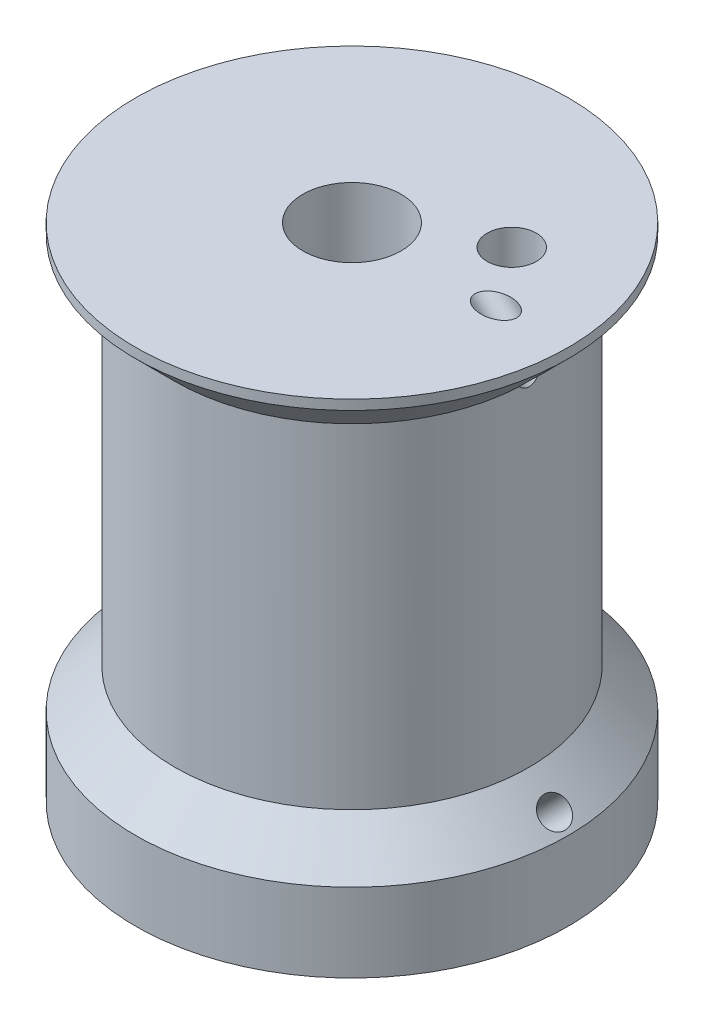
ISO-10303-21;
HEADER;
FILE_DESCRIPTION(('STEP AP214'),'2;1');
FILE_NAME('part.step','',(''),(''),'','','');
FILE_SCHEMA(('AUTOMOTIVE_DESIGN { 1 0 10303 214 1 1 1 1 }'));
ENDSEC;
DATA;
#1=APPLICATION_CONTEXT('core data for automotive mechanical design processes');
#2=APPLICATION_PROTOCOL_DEFINITION('international standard','automotive_design',2000,#1);
#3=PRODUCT_CONTEXT('',#1,'mechanical');
#4=PRODUCT('Part','Part','',(#3));
#5=PRODUCT_RELATED_PRODUCT_CATEGORY('part','',(#4));
#6=PRODUCT_DEFINITION_FORMATION('','',#4);
#7=PRODUCT_DEFINITION_CONTEXT('part definition',#1,'design');
#8=PRODUCT_DEFINITION('design','',#6,#7);
#9=PRODUCT_DEFINITION_SHAPE('','',#8);
#10=(LENGTH_UNIT() NAMED_UNIT(*) SI_UNIT(.MILLI.,.METRE.));
#11=(NAMED_UNIT(*) PLANE_ANGLE_UNIT() SI_UNIT($,.RADIAN.));
#12=(NAMED_UNIT(*) SI_UNIT($,.STERADIAN.) SOLID_ANGLE_UNIT());
#13=UNCERTAINTY_MEASURE_WITH_UNIT(LENGTH_MEASURE(1.E-05),#10,'distance_accuracy_value','');
#14=(GEOMETRIC_REPRESENTATION_CONTEXT(3) GLOBAL_UNCERTAINTY_ASSIGNED_CONTEXT((#13)) GLOBAL_UNIT_ASSIGNED_CONTEXT((#10,
#11,#12)) REPRESENTATION_CONTEXT('',''));
#15=CARTESIAN_POINT('',(0.,0.,0.));
#16=DIRECTION('',(0.,0.,1.));
#17=DIRECTION('',(1.,0.,0.));
#18=AXIS2_PLACEMENT_3D('',#15,#16,#17);
#19=CARTESIAN_POINT('',(0.,0.,0.));
#20=DIRECTION('',(0.,-1.,0.));
#21=DIRECTION('',(0.,0.,-1.));
#22=AXIS2_PLACEMENT_3D('',#19,#20,#21);
#23=CYLINDRICAL_SURFACE('',#22,2.5);
#24=CARTESIAN_POINT('',(-2.1650635094611,2.,-1.25));
#25=CARTESIAN_POINT('',(-2.16506918410574,2.06513476024406,-1.24999545384316));
#26=CARTESIAN_POINT('',(-2.16804751484696,2.13035176440631,-1.24487496341652));
#27=CARTESIAN_POINT('',(-2.17952958065066,2.25878408084644,-1.22465401237256));
#28=CARTESIAN_POINT('',(-2.18804492569449,2.32199489380426,-1.20953258069272));
#29=CARTESIAN_POINT('',(-2.20936683256748,2.44431458042993,-1.17012493587476));
#30=CARTESIAN_POINT('',(-2.22215054341565,2.50344331559198,-1.14588744061716));
#31=CARTESIAN_POINT('',(-2.25053331021072,2.6167802524959,-1.08908440672046));
#32=CARTESIAN_POINT('',(-2.26613251845081,2.67098818782807,-1.05651841754472));
#33=CARTESIAN_POINT('',(-2.29996086321802,2.77788216069688,-0.980833175663597));
#34=CARTESIAN_POINT('',(-2.31830079547442,2.83007391959193,-0.937065045179712));
#35=CARTESIAN_POINT('',(-2.35464978482132,2.92676048550839,-0.841567259518084));
#36=CARTESIAN_POINT('',(-2.37265867289062,2.9712514532294,-0.789833657227865));
#37=CARTESIAN_POINT('',(-2.40776846191186,3.05420893893458,-0.675611954268181));
#38=CARTESIAN_POINT('',(-2.42472633022716,3.09206720982441,-0.612633986265717));
#39=CARTESIAN_POINT('',(-2.45438445124411,3.1564260665572,-0.480196283249379));
#40=CARTESIAN_POINT('',(-2.46708738979677,3.18293382017146,-0.410740672672693));
#41=CARTESIAN_POINT('',(-2.48600576555297,3.22188082662637,-0.272556179907471));
#42=CARTESIAN_POINT('',(-2.49261850276115,3.23518690794442,-0.204127238111021));
#43=CARTESIAN_POINT('',(-2.50009479807584,3.2502076483438,-0.0657132858723097));
#44=CARTESIAN_POINT('',(-2.50096183480737,3.25192932099464,0.00427075730467342));
#45=CARTESIAN_POINT('',(-2.49703727395563,3.24406665753706,0.137290655529688));
#46=CARTESIAN_POINT('',(-2.492731198652,3.23545248059847,0.200401498970989));
#47=CARTESIAN_POINT('',(-2.47967806574684,3.20889894511918,0.324142214897902));
#48=CARTESIAN_POINT('',(-2.47093067582992,3.19095888877972,0.384771901367407));
#49=CARTESIAN_POINT('',(-2.44964479109568,3.14614679238773,0.502886739461942));
#50=CARTESIAN_POINT('',(-2.43705551911499,3.11915460853491,0.560316779393972));
#51=CARTESIAN_POINT('',(-2.40922057483359,3.05717072974813,0.66997100189166));
#52=CARTESIAN_POINT('',(-2.39397395196855,3.02217617087206,0.722193311048306));
#53=CARTESIAN_POINT('',(-2.36055492999036,2.94138081058373,0.825217076122743));
#54=CARTESIAN_POINT('',(-2.34224219997719,2.89487121459249,0.8754175937867));
#55=CARTESIAN_POINT('',(-2.30567925733515,2.79426284383728,0.967630462872224));
#56=CARTESIAN_POINT('',(-2.28742910332036,2.74015828465742,1.00963651446779));
#57=CARTESIAN_POINT('',(-2.25180195115606,2.62168975946989,1.08688166830276));
#58=CARTESIAN_POINT('',(-2.23455399988384,2.55689247118223,1.12152164372256));
#59=CARTESIAN_POINT('',(-2.2046931284822,2.42132791080125,1.17914889125154));
#60=CARTESIAN_POINT('',(-2.19207537557584,2.35056695872805,1.20214832276361));
#61=CARTESIAN_POINT('',(-2.17430794771293,2.21098186089651,1.2339752637813));
#62=CARTESIAN_POINT('',(-2.16864569810621,2.14244860119556,1.24378140264997));
#63=CARTESIAN_POINT('',(-2.16397399202012,2.00449832310432,1.25189618326428));
#64=CARTESIAN_POINT('',(-2.1649598361164,1.93508196360027,1.25021294664378));
#65=CARTESIAN_POINT('',(-2.17292920675731,1.80543260177659,1.23629505417996));
#66=CARTESIAN_POINT('',(-2.17924484383318,1.74502568611509,1.22523477089058));
#67=CARTESIAN_POINT('',(-2.19617526939176,1.6270402671613,1.19462035579055));
#68=CARTESIAN_POINT('',(-2.20679145006292,1.56946268656674,1.17506347327952));
#69=CARTESIAN_POINT('',(-2.23170277599571,1.45573583637163,1.12705948575611));
#70=CARTESIAN_POINT('',(-2.24614554053829,1.39977622893306,1.0982425796159));
#71=CARTESIAN_POINT('',(-2.27695149371562,1.29316341057626,1.03285883001975));
#72=CARTESIAN_POINT('',(-2.29331566693935,1.2425129456084,0.996288005415268));
#73=CARTESIAN_POINT('',(-2.3285999807042,1.14127654059557,0.911046458998565));
#74=CARTESIAN_POINT('',(-2.34758228942861,1.09150356160293,0.861431590393706));
#75=CARTESIAN_POINT('',(-2.38417793722366,1.00073470250801,0.754255619247859));
#76=CARTESIAN_POINT('',(-2.40179081259637,0.959741787211827,0.696691843319182));
#77=CARTESIAN_POINT('',(-2.43426702113696,0.886782842562374,0.573169203198445));
#78=CARTESIAN_POINT('',(-2.44904552090037,0.855083602236364,0.50702887196764));
#79=CARTESIAN_POINT('',(-2.47354193699126,0.803577620178261,0.369402955801351));
#80=CARTESIAN_POINT('',(-2.48326429595466,0.783760435792121,0.297922126740219));
#81=CARTESIAN_POINT('',(-2.49584385227353,0.758289294781675,0.15872460291302));
#82=CARTESIAN_POINT('',(-2.49924909885239,0.75150265515486,0.0912643048130703));
#83=CARTESIAN_POINT('',(-2.50052662968914,0.748945918182,-0.0439074824390054));
#84=CARTESIAN_POINT('',(-2.49840085083612,0.753171964345547,-0.111618875368859));
#85=CARTESIAN_POINT('',(-2.48917461047403,0.771770508494532,-0.240672490396434));
#86=CARTESIAN_POINT('',(-2.48241118334987,0.785456061572091,-0.30214039726408));
#87=CARTESIAN_POINT('',(-2.46490117079279,0.821658749128716,-0.421807440229522));
#88=CARTESIAN_POINT('',(-2.45415401415995,0.844177150116818,-0.480006106194386));
#89=CARTESIAN_POINT('',(-2.4290741343515,0.898408815207469,-0.594279257806106));
#90=CARTESIAN_POINT('',(-2.41460771498499,0.930474154009801,-0.650156428375057));
#91=CARTESIAN_POINT('',(-2.38360166427283,1.00244741357382,-0.75596830226753));
#92=CARTESIAN_POINT('',(-2.36706108197951,1.04235893639459,-0.805900259268633));
#93=CARTESIAN_POINT('',(-2.33160762783285,1.13349642377838,-0.903642505196113));
#94=CARTESIAN_POINT('',(-2.31262248764622,1.18545310934649,-0.950747105674088));
#95=CARTESIAN_POINT('',(-2.27578845203565,1.29681340141221,-1.03582910924334));
#96=CARTESIAN_POINT('',(-2.25794057202332,1.35622352608461,-1.07379843751257));
#97=CARTESIAN_POINT('',(-2.22499506631145,1.4832958082262,-1.14053884973207));
#98=CARTESIAN_POINT('',(-2.21000217820338,1.55115941391092,-1.16898133245117));
#99=CARTESIAN_POINT('',(-2.1858269541044,1.69166550542472,-1.21359838688301));
#100=CARTESIAN_POINT('',(-2.17662520184628,1.76429111114086,-1.22981398896918));
#101=CARTESIAN_POINT('',(-2.16911590752238,1.864756694565,-1.24295875983052));
#102=CARTESIAN_POINT('',(-2.1676016125644,1.89170986799736,-1.24559513120481));
#103=CARTESIAN_POINT('',(-2.16557419859688,1.94577060085281,-1.24911675636245));
#104=CARTESIAN_POINT('',(-2.16506114656387,1.97287817048234,-1.25000189299984));
#105=CARTESIAN_POINT('',(-2.1650635094611,2.,-1.25));
#106=B_SPLINE_CURVE_WITH_KNOTS('',3,(#24,#25,#26,#27,#28,#29,#30,#31,#32,#33,#34,#35,#36,#37,
#38,#39,#40,#41,#42,#43,#44,#45,#46,#47,#48,#49,#50,#51,#52,#53,#54,#55,#56,#57,#58,#59,#60,#61,
#62,#63,#64,#65,#66,#67,#68,#69,#70,#71,#72,#73,#74,#75,#76,#77,#78,#79,#80,#81,#82,#83,#84,#85,
#86,#87,#88,#89,#90,#91,#92,#93,#94,#95,#96,#97,#98,#99,#100,#101,#102,#103,#104,#105),
.UNSPECIFIED.,.T.,.F.,(4,2,2,2,2,2,2,2,2,2,2,2,2,2,2,2,2,2,2,2,2,2,2,2,2,2,2,2,2,2,2,2,2,2,2,2,
2,2,2,2,4),(0.,0.195290153243394,0.390991116031005,0.585660744898606,0.780340906806436,
0.991077890622791,1.20191963855464,1.42697365298454,1.65188533704864,1.86079356209919,
2.0695752960755,2.26020121855673,2.45084140646819,2.64411918413933,2.83746624187839,
3.04908989321113,3.26087560307398,3.4861105216181,3.71110967764631,3.91827863567764,
4.12530116485466,4.30967729280031,4.49411315545078,4.68709120507609,4.88016857775058,
5.09758429475766,5.31507331222752,5.53830226766206,5.76133474760964,5.96390337986858,
6.16640108492464,6.35555531089365,6.54473666890015,6.74200938399339,6.93937287625898,
7.15637802312583,7.37357428556442,7.59763436298255,7.82093916253449,7.90225168981635,
7.98356965618174),.UNSPECIFIED.);
#107=CARTESIAN_POINT('',(-2.1650635094611,2.,-1.25));
#108=VERTEX_POINT('',#107);
#109=EDGE_CURVE('E80',#108,#108,#106,.T.);
#110=ORIENTED_EDGE('',*,*,#109,.F.);
#111=EDGE_LOOP('',(#110));
#112=FACE_BOUND('',#111,.T.);
#113=CARTESIAN_POINT('',(0.,0.,0.));
#114=DIRECTION('',(0.,-1.,0.));
#115=DIRECTION('',(0.,0.,-1.));
#116=AXIS2_PLACEMENT_3D('',#113,#114,#115);
#117=CIRCLE('',#116,2.5);
#118=CARTESIAN_POINT('',(0.,0.,-2.5));
#119=VERTEX_POINT('',#118);
#120=EDGE_CURVE('E165',#119,#119,#117,.T.);
#121=ORIENTED_EDGE('',*,*,#120,.T.);
#122=EDGE_LOOP('',(#121));
#123=FACE_BOUND('',#122,.T.);
#124=CARTESIAN_POINT('',(0.,25.5,0.));
#125=DIRECTION('',(0.,-1.,0.));
#126=DIRECTION('',(0.,0.,-1.));
#127=AXIS2_PLACEMENT_3D('',#124,#125,#126);
#128=CIRCLE('',#127,2.5);
#129=CARTESIAN_POINT('',(0.,25.5,-2.5));
#130=VERTEX_POINT('',#129);
#131=EDGE_CURVE('E73',#130,#130,#128,.T.);
#132=ORIENTED_EDGE('',*,*,#131,.F.);
#133=EDGE_LOOP('',(#132));
#134=FACE_BOUND('',#133,.T.);
#135=ADVANCED_FACE('F44',(#112,#123,#134),#23,.F.);
#136=CARTESIAN_POINT('',(2.5,25.5,0.));
#137=DIRECTION('',(0.,1.,0.));
#138=DIRECTION('',(0.,0.,1.));
#139=AXIS2_PLACEMENT_3D('',#136,#137,#138);
#140=PLANE('',#139);
#141=CARTESIAN_POINT('',(7.32304473782996,25.5,0.));
#142=DIRECTION('',(0.,1.,0.));
#143=DIRECTION('',(1.,0.,0.));
#144=AXIS2_PLACEMENT_3D('',#141,#142,#143);
#145=ELLIPSE('',#144,1.06066017177983,0.750000000000008);
#146=CARTESIAN_POINT('',(8.38370490960979,25.5,0.));
#147=VERTEX_POINT('',#146);
#148=EDGE_CURVE('E79',#147,#147,#145,.T.);
#149=ORIENTED_EDGE('',*,*,#148,.F.);
#150=EDGE_LOOP('',(#149));
#151=FACE_BOUND('',#150,.T.);
#152=CARTESIAN_POINT('',(5.15285115251741,25.5,-2.97500000000001));
#153=DIRECTION('',(0.,-1.,0.));
#154=DIRECTION('',(0.,0.,-1.));
#155=AXIS2_PLACEMENT_3D('',#152,#153,#154);
#156=CIRCLE('',#155,1.25);
#157=CARTESIAN_POINT('',(5.15285115251741,25.5,-4.225));
#158=VERTEX_POINT('',#157);
#159=EDGE_CURVE('E156',#158,#158,#156,.T.);
#160=ORIENTED_EDGE('',*,*,#159,.T.);
#161=EDGE_LOOP('',(#160));
#162=FACE_BOUND('',#161,.T.);
#163=ORIENTED_EDGE('',*,*,#131,.T.);
#164=EDGE_LOOP('',(#163));
#165=FACE_BOUND('',#164,.T.);
#166=CARTESIAN_POINT('',(0.,25.5,0.));
#167=DIRECTION('',(0.,-1.,0.));
#168=DIRECTION('',(0.,0.,-1.));
#169=AXIS2_PLACEMENT_3D('',#166,#167,#168);
#170=CIRCLE('',#169,11.);
#171=CARTESIAN_POINT('',(0.,25.5,-11.));
#172=VERTEX_POINT('',#171);
#173=EDGE_CURVE('E90',#172,#172,#170,.T.);
#174=ORIENTED_EDGE('',*,*,#173,.F.);
#175=EDGE_LOOP('',(#174));
#176=FACE_BOUND('',#175,.T.);
#177=ADVANCED_FACE('F142',(#151,#162,#165,#176),#140,.T.);
#178=CARTESIAN_POINT('',(0.,0.,0.));
#179=DIRECTION('',(0.,-1.,0.));
#180=DIRECTION('',(0.,0.,-1.));
#181=AXIS2_PLACEMENT_3D('',#178,#179,#180);
#182=CYLINDRICAL_SURFACE('',#181,11.);
#183=ORIENTED_EDGE('',*,*,#173,.T.);
#184=EDGE_LOOP('',(#183));
#185=FACE_BOUND('',#184,.T.);
#186=CARTESIAN_POINT('',(0.,25.,0.));
#187=DIRECTION('',(0.,-1.,0.));
#188=DIRECTION('',(0.,0.,-1.));
#189=AXIS2_PLACEMENT_3D('',#186,#187,#188);
#190=CIRCLE('',#189,11.);
#191=CARTESIAN_POINT('',(0.,25.,-11.));
#192=VERTEX_POINT('',#191);
#193=EDGE_CURVE('E85',#192,#192,#190,.T.);
#194=ORIENTED_EDGE('',*,*,#193,.F.);
#195=EDGE_LOOP('',(#194));
#196=FACE_BOUND('',#195,.T.);
#197=ADVANCED_FACE('F140',(#185,#196),#182,.T.);
#198=CARTESIAN_POINT('',(0.,23.,0.));
#199=DIRECTION('',(0.,1.,0.));
#200=DIRECTION('',(0.,0.,1.));
#201=AXIS2_PLACEMENT_3D('',#198,#199,#200);
#202=CONICAL_SURFACE('',#201,9.,0.785398163397446);
#203=CARTESIAN_POINT('',(8.88161431999982,22.8816678967813,-0.030849627066394));
#204=CARTESIAN_POINT('',(8.88274582869261,22.8829334226516,-0.0729732285452958));
#205=CARTESIAN_POINT('',(8.8862803370737,22.8869253125928,-0.11494516954378));
#206=CARTESIAN_POINT('',(8.89797107778,22.9000673054394,-0.197317977882754));
#207=CARTESIAN_POINT('',(8.90611722039618,22.9092061472003,-0.237722069963994));
#208=CARTESIAN_POINT('',(8.92530067419323,22.9306220818726,-0.310032418678407));
#209=CARTESIAN_POINT('',(8.93572230089305,22.9422242228074,-0.34230512522119));
#210=CARTESIAN_POINT('',(8.9596006444316,22.9686666571026,-0.404306417190066));
#211=CARTESIAN_POINT('',(8.97305787615031,22.983507499777,-0.434034569843808));
#212=CARTESIAN_POINT('',(9.00545280097263,23.0190103289053,-0.495388150055858));
#213=CARTESIAN_POINT('',(9.02494037323841,23.0402388304158,-0.526399880168298));
#214=CARTESIAN_POINT('',(9.06736053994946,23.0860536704431,-0.583161969563023));
#215=CARTESIAN_POINT('',(9.09029493706475,23.1106417653934,-0.608909558998339));
#216=CARTESIAN_POINT('',(9.13902386013079,23.1623986028429,-0.654395823276607));
#217=CARTESIAN_POINT('',(9.16481794618277,23.1895669483367,-0.674135420569048));
#218=CARTESIAN_POINT('',(9.21859157332957,23.2456548307265,-0.707043960466121));
#219=CARTESIAN_POINT('',(9.24657081461639,23.2745741272663,-0.720213802630004));
#220=CARTESIAN_POINT('',(9.3039345582121,23.3332820176307,-0.739601501095803));
#221=CARTESIAN_POINT('',(9.33331779387443,23.3630698187958,-0.745825504717208));
#222=CARTESIAN_POINT('',(9.392690786181,23.4226794300728,-0.751163975654432));
#223=CARTESIAN_POINT('',(9.42268055581832,23.4525012409004,-0.750278290506272));
#224=CARTESIAN_POINT('',(9.48236980997519,23.5113094453906,-0.741427583423478));
#225=CARTESIAN_POINT('',(9.51206956872455,23.540296691851,-0.733470073581445));
#226=CARTESIAN_POINT('',(9.57033639836122,23.596680207193,-0.710713898155468));
#227=CARTESIAN_POINT('',(9.59890346914631,23.624076475931,-0.695915231954133));
#228=CARTESIAN_POINT('',(9.65406701187643,23.6765729080305,-0.659885010395318));
#229=CARTESIAN_POINT('',(9.68066205213758,23.7016714062652,-0.638648837264752));
#230=CARTESIAN_POINT('',(9.73104614189844,23.7489031848808,-0.59034950160208));
#231=CARTESIAN_POINT('',(9.75483516642883,23.7710364388756,-0.563286287224118));
#232=CARTESIAN_POINT('',(9.7988982348556,23.8118059298411,-0.504058692704155));
#233=CARTESIAN_POINT('',(9.81916763257134,23.8304375470095,-0.47188767544934));
#234=CARTESIAN_POINT('',(9.85551427275934,23.8637037719416,-0.403380406728823));
#235=CARTESIAN_POINT('',(9.87159151480563,23.8783383792992,-0.36704415483987));
#236=CARTESIAN_POINT('',(9.89904034437634,23.9032494709511,-0.291236762362103));
#237=CARTESIAN_POINT('',(9.91041207326956,23.9135260861739,-0.2517657159951));
#238=CARTESIAN_POINT('',(9.92808367640848,23.9294697255588,-0.17080874449825));
#239=CARTESIAN_POINT('',(9.93438359309978,23.9351367882979,-0.129322836233704));
#240=CARTESIAN_POINT('',(9.94170249492394,23.9417187283792,-0.0455687183761259));
#241=CARTESIAN_POINT('',(9.94272800172335,23.9426394744181,-0.0033015397676239));
#242=CARTESIAN_POINT('',(9.93948236525668,23.9397221793188,0.0808634707939466));
#243=CARTESIAN_POINT('',(9.93521124288315,23.9358841569517,0.12276130420324));
#244=CARTESIAN_POINT('',(9.92151519939422,23.9235467154391,0.204972690916994));
#245=CARTESIAN_POINT('',(9.91209335999349,23.9150500835675,0.245287176107481));
#246=CARTESIAN_POINT('',(9.88840172288213,23.8936046553429,0.323217035604245));
#247=CARTESIAN_POINT('',(9.8741318989955,23.880655834951,0.360832395335652));
#248=CARTESIAN_POINT('',(9.8411849692463,23.850609511234,0.432334012359926));
#249=CARTESIAN_POINT('',(9.82250386433773,23.833508243108,0.466216844815542));
#250=CARTESIAN_POINT('',(9.78133192964549,23.7955861358268,0.529257062809947));
#251=CARTESIAN_POINT('',(9.75884106769669,23.7747652652675,0.558414408448193));
#252=CARTESIAN_POINT('',(9.71072507811604,23.7299014451254,0.611208429231745));
#253=CARTESIAN_POINT('',(9.68509655706882,23.7058550043144,0.634839045349554));
#254=CARTESIAN_POINT('',(9.6315149388439,23.6551736684123,0.675867475541703));
#255=CARTESIAN_POINT('',(9.60356184234548,23.6285387740777,0.693265291437363));
#256=CARTESIAN_POINT('',(9.54619021898808,23.5733901478848,0.721326632907051));
#257=CARTESIAN_POINT('',(9.516772232887,23.5448771080996,0.731992623913005));
#258=CARTESIAN_POINT('',(9.45733883499075,23.4867340417291,0.746294271594801));
#259=CARTESIAN_POINT('',(9.42732344407161,23.4571040541428,0.749930173499623));
#260=CARTESIAN_POINT('',(9.36761247220403,23.3975932338718,0.750067734622433));
#261=CARTESIAN_POINT('',(9.33791649329497,23.3677128233757,0.746579649666177));
#262=CARTESIAN_POINT('',(9.27963539760036,23.308506665282,0.732587676749721));
#263=CARTESIAN_POINT('',(9.25105044326983,23.279180999119,0.722082766836492));
#264=CARTESIAN_POINT('',(9.1957819296247,23.2219523776551,0.694360536498083));
#265=CARTESIAN_POINT('',(9.16909831761696,23.1940493829327,0.677143402178818));
#266=CARTESIAN_POINT('',(9.11834487413941,23.14051375168,0.636487769439473));
#267=CARTESIAN_POINT('',(9.09427327425245,23.1148795812766,0.613053517709259));
#268=CARTESIAN_POINT('',(9.05614895793403,23.0739641475048,0.568583342789967));
#269=CARTESIAN_POINT('',(9.04126642131312,23.0578947630582,0.548961608468778));
#270=CARTESIAN_POINT('',(9.01324929874434,23.0274926891902,0.507306072353426));
#271=CARTESIAN_POINT('',(9.00011276126508,23.013158062434,0.485275014588835));
#272=CARTESIAN_POINT('',(8.97991223712239,22.9910193979255,0.447015889580604));
#273=CARTESIAN_POINT('',(8.97230990920025,22.9826607473243,0.431386295454281));
#274=CARTESIAN_POINT('',(8.95795797338659,22.9668395487621,0.399308918148919));
#275=CARTESIAN_POINT('',(8.95120836377152,22.9593769989899,0.382861136623731));
#276=CARTESIAN_POINT('',(8.93112895469329,22.9371259545831,0.329321680222511));
#277=CARTESIAN_POINT('',(8.91945562798399,22.9241089385642,0.290816714827937));
#278=CARTESIAN_POINT('',(8.9053141648647,22.9082935473374,0.231233426377925));
#279=CARTESIAN_POINT('',(8.90115453430154,22.9036319056499,0.211005731978682));
#280=CARTESIAN_POINT('',(8.89399509612589,22.8955982473684,0.170102743907071));
#281=CARTESIAN_POINT('',(8.8909948249382,22.8922257153238,0.149427632635781));
#282=CARTESIAN_POINT('',(8.88857964345208,22.8895096691334,0.12858491212465));
#283=B_SPLINE_CURVE_WITH_KNOTS('',3,(#203,#204,#205,#206,#207,#208,#209,#210,#211,#212,#213,
#214,#215,#216,#217,#218,#219,#220,#221,#222,#223,#224,#225,#226,#227,#228,#229,#230,#231,#232,
#233,#234,#235,#236,#237,#238,#239,#240,#241,#242,#243,#244,#245,#246,#247,#248,#249,#250,#251,
#252,#253,#254,#255,#256,#257,#258,#259,#260,#261,#262,#263,#264,#265,#266,#267,#268,#269,#270,
#271,#272,#273,#274,#275,#276,#277,#278,#279,#280,#281,#282),.UNSPECIFIED.,.F.,.F.,(4,2,2,2,2,2,
2,2,2,2,2,2,2,2,2,2,2,2,2,2,2,2,2,2,2,2,2,2,2,2,2,2,2,2,2,2,2,2,2,4),(0.,0.126323120079672,
0.252370922406531,0.359541784081294,0.466730837080839,0.59311640927633,0.719568311925693,
0.846000789715478,0.97241595106931,1.09871914146294,1.22502504037715,1.35119693017318,
1.47736883135581,1.60363145360113,1.72989519930927,1.85632437634916,1.98275356623613,
2.10917895750652,2.23560329072183,2.36187126599043,2.48813874319675,2.61433075612492,
2.74052345041959,2.86683098686996,2.99313958976636,3.11958602408659,3.24603242145719,
3.37243248278037,3.49882813483975,3.62504195359989,3.75127415855715,3.8775028637969,
4.00364556774543,4.09168044539758,4.17961608238923,4.23741846506333,4.29522073090279,
4.42137125551434,4.48482135763164,4.54824606261526),.UNSPECIFIED.);
#284=CARTESIAN_POINT('',(8.98810663157903,23.,-0.462535597943624));
#285=VERTEX_POINT('',#284);
#286=CARTESIAN_POINT('',(8.98810663157903,23.,0.462535597943621));
#287=VERTEX_POINT('',#286);
#288=EDGE_CURVE('E66',#285,#287,#283,.T.);
#289=ORIENTED_EDGE('',*,*,#288,.F.);
#290=CARTESIAN_POINT('',(0.,23.,0.));
#291=DIRECTION('',(0.,-1.,0.));
#292=DIRECTION('',(0.,0.,-1.));
#293=AXIS2_PLACEMENT_3D('',#290,#291,#292);
#294=CIRCLE('',#293,9.);
#295=EDGE_CURVE('E77',#287,#285,#294,.T.);
#296=ORIENTED_EDGE('',*,*,#295,.F.);
#297=EDGE_LOOP('',(#289,#296));
#298=FACE_BOUND('',#297,.T.);
#299=ORIENTED_EDGE('',*,*,#193,.T.);
#300=EDGE_LOOP('',(#299));
#301=FACE_BOUND('',#300,.T.);
#302=ADVANCED_FACE('F75',(#298,#301),#202,.T.);
#303=CARTESIAN_POINT('',(0.,0.,0.));
#304=DIRECTION('',(0.,-1.,0.));
#305=DIRECTION('',(0.,0.,-1.));
#306=AXIS2_PLACEMENT_3D('',#303,#304,#305);
#307=CYLINDRICAL_SURFACE('',#306,9.);
#308=CARTESIAN_POINT('',(8.98810663157903,23.,0.462535597943624));
#309=CARTESIAN_POINT('',(8.98938034335362,22.9712603139431,0.437751411739013));
#310=CARTESIAN_POINT('',(8.99065375420055,22.9439667611519,0.411040257737929));
#311=CARTESIAN_POINT('',(8.9930966306683,22.893391359135,0.353631129830954));
#312=CARTESIAN_POINT('',(8.99426500603353,22.8701496546463,0.322898022253863));
#313=CARTESIAN_POINT('',(8.99618582641261,22.8328878352046,0.26337140129142));
#314=CARTESIAN_POINT('',(8.99697524109227,22.8179696292036,0.235150415214562));
#315=CARTESIAN_POINT('',(8.99831250364838,22.7930374967018,0.176697864955878));
#316=CARTESIAN_POINT('',(8.99886119861095,22.7830063587408,0.146473789039552));
#317=CARTESIAN_POINT('',(8.99965773861761,22.7685279439411,0.0844289748867665));
#318=CARTESIAN_POINT('',(8.99990313158228,22.7641261685428,0.0525973611904858));
#319=CARTESIAN_POINT('',(9.00004958344311,22.7614928519145,-0.0113389508008687));
#320=CARTESIAN_POINT('',(8.99995054371652,22.7632630779378,-0.0434437246855372));
#321=CARTESIAN_POINT('',(8.99945275363935,22.7722530702756,-0.10316028673399));
#322=CARTESIAN_POINT('',(8.99908893583646,22.7788380557168,-0.130871534681401));
#323=CARTESIAN_POINT('',(8.99814075702215,22.7962441993527,-0.184918559769681));
#324=CARTESIAN_POINT('',(8.99755628723906,22.8070674469213,-0.211253651225462));
#325=CARTESIAN_POINT('',(8.99598775236296,22.8366797209498,-0.270876683578972));
#326=CARTESIAN_POINT('',(8.99493539124961,22.8569283753646,-0.303436117591944));
#327=CARTESIAN_POINT('',(8.99265560419564,22.9023966975402,-0.364822959583717));
#328=CARTESIAN_POINT('',(8.99142800847248,22.9276211954902,-0.393646695807122));
#329=CARTESIAN_POINT('',(8.98948717739386,22.9692903660139,-0.435117905442909));
#330=CARTESIAN_POINT('',(8.98879750916101,22.9844265534231,-0.449100398248913));
#331=CARTESIAN_POINT('',(8.98810663157903,23.,-0.462535597943638));
#332=B_SPLINE_CURVE_WITH_KNOTS('',3,(#308,#309,#310,#311,#312,#313,#314,#315,#316,#317,#318,
#319,#320,#321,#322,#323,#324,#325,#326,#327,#328,#329,#330,#331),.UNSPECIFIED.,.F.,.F.,(4,2,2,
2,2,2,2,2,2,2,2,4),(0.,0.114098687434545,0.229270484127822,0.324673752160922,0.419738551837097,
0.515566990235433,0.611422869819685,0.696506385610814,0.78163189869223,0.896070279386068,
1.01062030016049,1.0724003739315),.UNSPECIFIED.);
#333=EDGE_CURVE('E58',#287,#285,#332,.T.);
#334=ORIENTED_EDGE('',*,*,#333,.F.);
#335=ORIENTED_EDGE('',*,*,#295,.T.);
#336=EDGE_LOOP('',(#334,#335));
#337=FACE_BOUND('',#336,.T.);
#338=CARTESIAN_POINT('',(0.,5.99999999999999,0.));
#339=DIRECTION('',(0.,-1.,0.));
#340=DIRECTION('',(0.,0.,-1.));
#341=AXIS2_PLACEMENT_3D('',#338,#339,#340);
#342=CIRCLE('',#341,9.);
#343=CARTESIAN_POINT('',(0.,5.99999999999999,-9.));
#344=VERTEX_POINT('',#343);
#345=EDGE_CURVE('E86',#344,#344,#342,.T.);
#346=ORIENTED_EDGE('',*,*,#345,.F.);
#347=EDGE_LOOP('',(#346));
#348=FACE_BOUND('',#347,.T.);
#349=ADVANCED_FACE('F82',(#337,#348),#307,.T.);
#350=CARTESIAN_POINT('',(0.,4.,0.));
#351=DIRECTION('',(0.,-1.,0.));
#352=DIRECTION('',(0.,0.,-1.));
#353=AXIS2_PLACEMENT_3D('',#350,#351,#352);
#354=CONICAL_SURFACE('',#353,11.,0.78539816339745);
#355=CARTESIAN_POINT('',(9.9631797927056,5.02031448599402,-0.573734587316648));
#356=CARTESIAN_POINT('',(9.94115291455935,5.04386493421888,-0.546598623625871));
#357=CARTESIAN_POINT('',(9.92076097358022,5.06584062633196,-0.516722279117505));
#358=CARTESIAN_POINT('',(9.88377466275405,5.10592926216682,-0.452337877536927));
#359=CARTESIAN_POINT('',(9.86718480594557,5.12403761367275,-0.417824392479662));
#360=CARTESIAN_POINT('',(9.83823055839378,5.15578077407838,-0.345175044796419));
#361=CARTESIAN_POINT('',(9.82586435061316,5.16941750659238,-0.307040748909909));
#362=CARTESIAN_POINT('',(9.80564720051552,5.19177494534494,-0.228231264908273));
#363=CARTESIAN_POINT('',(9.79779512414358,5.20049688628267,-0.187556717812581));
#364=CARTESIAN_POINT('',(9.78678885788826,5.21273648909006,-0.104842086405908));
#365=CARTESIAN_POINT('',(9.78363139369152,5.21625777820503,-0.0628029747575339));
#366=CARTESIAN_POINT('',(9.78207775596649,5.21798942136423,0.0214735839295831));
#367=CARTESIAN_POINT('',(9.78368173740344,5.21619960255398,0.0637110373788593));
#368=CARTESIAN_POINT('',(9.79160983951947,5.20737329838287,0.14713877526187));
#369=CARTESIAN_POINT('',(9.79792916998201,5.20034213759003,0.188330078574184));
#370=CARTESIAN_POINT('',(9.81513487568354,5.18127327101196,0.268542679287046));
#371=CARTESIAN_POINT('',(9.82602126476407,5.16923555005316,0.307563970110451));
#372=CARTESIAN_POINT('',(9.85211330440535,5.14053911936981,0.382358815494115));
#373=CARTESIAN_POINT('',(9.86732187686605,5.12387728381189,0.418130151344092));
#374=CARTESIAN_POINT('',(9.90169029647595,5.08647435900022,0.485385090628383));
#375=CARTESIAN_POINT('',(9.92085016864672,5.06573324391451,0.516868666908395));
#376=CARTESIAN_POINT('',(9.96267617681338,5.02080071104094,0.574694434059573));
#377=CARTESIAN_POINT('',(9.98534658127262,4.99660509575026,0.60103027640819));
#378=CARTESIAN_POINT('',(10.0336015335835,4.94553426284994,0.647765097723217));
#379=CARTESIAN_POINT('',(10.0591860791319,4.91865904735816,0.668164081381902));
#380=CARTESIAN_POINT('',(10.1125932896623,4.86305120377964,0.702440699388722));
#381=CARTESIAN_POINT('',(10.1404154928487,4.83431895917562,0.71631967527665));
#382=CARTESIAN_POINT('',(10.1975487297479,4.7758451401449,0.737165563644688));
#383=CARTESIAN_POINT('',(10.2268597508585,4.74610357426238,0.744132534621736));
#384=CARTESIAN_POINT('',(10.2861153774062,4.68650906473225,0.750950822635799));
#385=CARTESIAN_POINT('',(10.3160591697763,4.65665630031188,0.750810774831437));
#386=CARTESIAN_POINT('',(10.3757569192181,4.59764436726409,0.743440788109808));
#387=CARTESIAN_POINT('',(10.4055108765487,4.56848519769084,0.736210858861139));
#388=CARTESIAN_POINT('',(10.4639492683511,4.51166765238241,0.714870819563185));
#389=CARTESIAN_POINT('',(10.4926339792588,4.48400888788874,0.700762501274244));
#390=CARTESIAN_POINT('',(10.5480862086227,4.43092217359872,0.666068182896486));
#391=CARTESIAN_POINT('',(10.5748537140905,4.40549423891509,0.645482138928758));
#392=CARTESIAN_POINT('',(10.6256864195977,4.35750683975816,0.598391335743807));
#393=CARTESIAN_POINT('',(10.6497487749806,4.3349503916182,0.571880432022058));
#394=CARTESIAN_POINT('',(10.6943976961991,4.29331407876543,0.513702805662361));
#395=CARTESIAN_POINT('',(10.7149842450292,4.27423423106193,0.482036057800828));
#396=CARTESIAN_POINT('',(10.7520526045689,4.24001933167818,0.414417433626332));
#397=CARTESIAN_POINT('',(10.7685313997897,4.22488717761,0.378462437782754));
#398=CARTESIAN_POINT('',(10.7968433572382,4.19896406378902,0.30330500258384));
#399=CARTESIAN_POINT('',(10.8086765386688,4.18817308609167,0.264102576652802));
#400=CARTESIAN_POINT('',(10.8273136390078,4.17120543328313,0.183588277609497));
#401=CARTESIAN_POINT('',(10.8341206533128,4.16502591814852,0.142277719593181));
#402=CARTESIAN_POINT('',(10.8424986159879,4.15742314427964,0.0586991568197074));
#403=CARTESIAN_POINT('',(10.844069597463,4.15599985547388,0.0164311581177186));
#404=CARTESIAN_POINT('',(10.841926027722,4.15794363772392,-0.067817558419549));
#405=CARTESIAN_POINT('',(10.8382167441945,4.16130593459175,-0.109798520642711));
#406=CARTESIAN_POINT('',(10.8256414109314,4.1727293228843,-0.192324068674023));
#407=CARTESIAN_POINT('',(10.8167753642434,4.18079041153217,-0.232868655331017));
#408=CARTESIAN_POINT('',(10.7941690531923,4.20141319554295,-0.31137602557259));
#409=CARTESIAN_POINT('',(10.7804283331092,4.21397531169578,-0.349338567373252));
#410=CARTESIAN_POINT('',(10.7485086688445,4.24328852878527,-0.421604235459344));
#411=CARTESIAN_POINT('',(10.7303296853371,4.26003966683926,-0.455907329315952));
#412=CARTESIAN_POINT('',(10.6900829183299,4.2973319404294,-0.519918619510079));
#413=CARTESIAN_POINT('',(10.6680110860282,4.31787702295712,-0.549621970832914));
#414=CARTESIAN_POINT('',(10.6206772040672,4.36222488845078,-0.603549914183064));
#415=CARTESIAN_POINT('',(10.5954151376112,4.38602768856875,-0.627774477362516));
#416=CARTESIAN_POINT('',(10.5424627759047,4.43628885109231,-0.670067601429747));
#417=CARTESIAN_POINT('',(10.5147713456593,4.46274845559588,-0.68813326542447));
#418=CARTESIAN_POINT('',(10.4578090216591,4.51761431782162,-0.717577187255727));
#419=CARTESIAN_POINT('',(10.4285381977291,4.5460204895011,-0.72895574046508));
#420=CARTESIAN_POINT('',(10.369315649872,4.60398270793193,-0.744693471104523));
#421=CARTESIAN_POINT('',(10.3393646195252,4.63353760348554,-0.749059499407386));
#422=CARTESIAN_POINT('',(10.2796171764736,4.69301101681191,-0.75066769107941));
#423=CARTESIAN_POINT('',(10.2498208017985,4.72292961848792,-0.747908178383529));
#424=CARTESIAN_POINT('',(10.1912528258573,4.78225308861612,-0.735346627178682));
#425=CARTESIAN_POINT('',(10.1624807466148,4.81165819333383,-0.725547919870115));
#426=CARTESIAN_POINT('',(10.1067605783605,4.86908888620091,-0.699196047682325));
#427=CARTESIAN_POINT('',(10.0798103980325,4.89711604562034,-0.682650785945098));
#428=CARTESIAN_POINT('',(10.0378541717596,4.9410954553659,-0.650516003219222));
#429=CARTESIAN_POINT('',(10.0220865676306,4.95771287172063,-0.63679281272851));
#430=CARTESIAN_POINT('',(9.99172087323401,4.98986868275979,-0.606990623431959));
#431=CARTESIAN_POINT('',(9.97712278338973,5.00540707705363,-0.59091162377335));
#432=CARTESIAN_POINT('',(9.9631797927056,5.02031448599402,-0.573734587316648));
#433=B_SPLINE_CURVE_WITH_KNOTS('',3,(#355,#356,#357,#358,#359,#360,#361,#362,#363,#364,#365,
#366,#367,#368,#369,#370,#371,#372,#373,#374,#375,#376,#377,#378,#379,#380,#381,#382,#383,#384,
#385,#386,#387,#388,#389,#390,#391,#392,#393,#394,#395,#396,#397,#398,#399,#400,#401,#402,#403,
#404,#405,#406,#407,#408,#409,#410,#411,#412,#413,#414,#415,#416,#417,#418,#419,#420,#421,#422,
#423,#424,#425,#426,#427,#428,#429,#430,#431,#432),.UNSPECIFIED.,.T.,.F.,(4,2,2,2,2,2,2,2,2,2,2,
2,2,2,2,2,2,2,2,2,2,2,2,2,2,2,2,2,2,2,2,2,2,2,2,2,2,2,4),(0.,0.12633656965516,0.252822331799376,
0.379253610322497,0.505653112468849,0.631964414349724,0.758279827183331,0.884467093446827,
1.01065474215358,1.13692790050038,1.26320185849556,1.38963057662584,1.51605919483121,
1.64246178800782,1.76886331141845,1.89511125833313,2.02135903308146,2.14757393894264,
2.27378969977854,2.40013696787453,2.52648485410923,2.65292522056987,2.7793650643746,
2.90572697430504,3.03208808530431,3.15832322446521,3.28455828902461,3.41080515806793,
3.53705314577647,3.66343322189354,3.78981396343333,3.91625406752925,4.04268858628665,
4.16899950978667,4.2953401467649,4.42162103415672,4.54775441489012,4.62772530156907,
4.7076962171964),.UNSPECIFIED.);
#434=CARTESIAN_POINT('',(9.9631797927056,5.02031448599402,-0.573734587316648));
#435=VERTEX_POINT('',#434);
#436=EDGE_CURVE('E107',#435,#435,#433,.T.);
#437=ORIENTED_EDGE('',*,*,#436,.F.);
#438=EDGE_LOOP('',(#437));
#439=FACE_BOUND('',#438,.T.);
#440=ORIENTED_EDGE('',*,*,#345,.T.);
#441=EDGE_LOOP('',(#440));
#442=FACE_BOUND('',#441,.T.);
#443=CARTESIAN_POINT('',(0.,4.,0.));
#444=DIRECTION('',(0.,-1.,0.));
#445=DIRECTION('',(0.,0.,-1.));
#446=AXIS2_PLACEMENT_3D('',#443,#444,#445);
#447=CIRCLE('',#446,11.);
#448=CARTESIAN_POINT('',(0.,4.,-11.));
#449=VERTEX_POINT('',#448);
#450=EDGE_CURVE('E94',#449,#449,#447,.T.);
#451=ORIENTED_EDGE('',*,*,#450,.F.);
#452=EDGE_LOOP('',(#451));
#453=FACE_BOUND('',#452,.T.);
#454=ADVANCED_FACE('F189',(#439,#442,#453),#354,.T.);
#455=CARTESIAN_POINT('',(0.,0.,0.));
#456=DIRECTION('',(0.,-1.,0.));
#457=DIRECTION('',(0.,0.,-1.));
#458=AXIS2_PLACEMENT_3D('',#455,#456,#457);
#459=CYLINDRICAL_SURFACE('',#458,11.);
#460=CARTESIAN_POINT('',(-11.,0.750000000000002,0.));
#461=CARTESIAN_POINT('',(-10.999999098796,0.75000300181186,0.0699710602463519));
#462=CARTESIAN_POINT('',(-10.9993252987046,0.755894934903591,0.139987069063113));
#463=CARTESIAN_POINT('',(-10.996702178266,0.7793079628343,0.278074243505269));
#464=CARTESIAN_POINT('',(-10.9947514907003,0.796841523154798,0.346143242753095));
#465=CARTESIAN_POINT('',(-10.9897945640633,0.843017540858324,0.478317045301571));
#466=CARTESIAN_POINT('',(-10.9867890005829,0.871652889372938,0.542424355017517));
#467=CARTESIAN_POINT('',(-10.9800574647103,0.939204897009987,0.664910051163532));
#468=CARTESIAN_POINT('',(-10.9763316253718,0.978119657742116,0.72328949268251));
#469=CARTESIAN_POINT('',(-10.968557071608,1.06531705174659,0.832943192201769));
#470=CARTESIAN_POINT('',(-10.9645070990459,1.11363734567632,0.884187415913991));
#471=CARTESIAN_POINT('',(-10.9565510031881,1.21819350340992,0.977857611459198));
#472=CARTESIAN_POINT('',(-10.9526448868951,1.27442975190413,1.0202831544839));
#473=CARTESIAN_POINT('',(-10.9454062056308,1.39341348322575,1.09522113283392));
#474=CARTESIAN_POINT('',(-10.9420752550327,1.45617852551518,1.12770585724159));
#475=CARTESIAN_POINT('',(-10.9363802408844,1.58631696754945,1.18166312999782));
#476=CARTESIAN_POINT('',(-10.9340161468672,1.65369022200522,1.20313602534931));
#477=CARTESIAN_POINT('',(-10.9305342775891,1.79082316719185,1.23436981435034));
#478=CARTESIAN_POINT('',(-10.9294111476981,1.86057125567857,1.24418104088519));
#479=CARTESIAN_POINT('',(-10.928521890078,2.00073240783944,1.25196865940665));
#480=CARTESIAN_POINT('',(-10.9287557169125,2.07114544916936,1.24994544765987));
#481=CARTESIAN_POINT('',(-10.9305490559729,2.2102888090358,1.23416301698983));
#482=CARTESIAN_POINT('',(-10.9321023319257,2.27902548124253,1.22045900541516));
#483=CARTESIAN_POINT('',(-10.9363498240334,2.41321702690382,1.18179000539199));
#484=CARTESIAN_POINT('',(-10.9390440596154,2.47867184445713,1.15682482519952));
#485=CARTESIAN_POINT('',(-10.9452770263127,2.60461456038531,1.09628205008229));
#486=CARTESIAN_POINT('',(-10.9488176820281,2.66509071066626,1.0606802226634));
#487=CARTESIAN_POINT('',(-10.9563429994385,2.77923074844801,0.979892129097649));
#488=CARTESIAN_POINT('',(-10.9603276779232,2.83289437818587,0.934705500466705));
#489=CARTESIAN_POINT('',(-10.9683198318057,2.93220668102333,0.835723376133609));
#490=CARTESIAN_POINT('',(-10.9723273076041,2.97780789501232,0.781880249551105));
#491=CARTESIAN_POINT('',(-10.9798921650149,3.05933220127938,0.667278205581041));
#492=CARTESIAN_POINT('',(-10.9834495458722,3.09525527732034,0.606519276591014));
#493=CARTESIAN_POINT('',(-10.9897150774974,3.15640268250194,0.479775541657342));
#494=CARTESIAN_POINT('',(-10.9924230139116,3.181624311744,0.413789421907935));
#495=CARTESIAN_POINT('',(-10.9966825017733,3.22061659603785,0.278481205096859));
#496=CARTESIAN_POINT('',(-10.9982340979176,3.23438769369753,0.209159237088376));
#497=CARTESIAN_POINT('',(-11.0000003081264,3.25002712152088,0.0695577812372834));
#498=CARTESIAN_POINT('',(-11.0002222716223,3.25196088285575,-0.00071428718998362));
#499=CARTESIAN_POINT('',(-10.9993239851522,3.24404302418306,-0.140581487877392));
#500=CARTESIAN_POINT('',(-10.9982037587135,3.23419161075723,-0.210176631981748));
#501=CARTESIAN_POINT('',(-10.994751592849,3.20303737153296,-0.346523396585517));
#502=CARTESIAN_POINT('',(-10.9924229265985,3.18176547385961,-0.413282173840754));
#503=CARTESIAN_POINT('',(-10.9868148348929,3.12840607278895,-0.542284372808936));
#504=CARTESIAN_POINT('',(-10.9835353823457,3.09631826119348,-0.604527665792277));
#505=CARTESIAN_POINT('',(-10.9763735736619,3.02207767403193,-0.723026006046938));
#506=CARTESIAN_POINT('',(-10.9724886880503,2.97988225284938,-0.779254179921578));
#507=CARTESIAN_POINT('',(-10.9645592695384,2.88668494139087,-0.883853426159773));
#508=CARTESIAN_POINT('',(-10.9605147314369,2.83568276402336,-0.932224242281435));
#509=CARTESIAN_POINT('',(-10.9526994422005,2.72603277643457,-1.01996547066726));
#510=CARTESIAN_POINT('',(-10.9489300605485,2.66735031149943,-1.05929271449872));
#511=CARTESIAN_POINT('',(-10.942113624429,2.54417501313466,-1.12753292733449));
#512=CARTESIAN_POINT('',(-10.9390665576492,2.4796822787693,-1.15644607385569));
#513=CARTESIAN_POINT('',(-10.9340487479586,2.34686064941341,-1.20296631338929));
#514=CARTESIAN_POINT('',(-10.9320756279092,2.27854059908403,-1.22059839191764));
#515=CARTESIAN_POINT('',(-10.9294220488897,2.13988581391373,-1.24413675347569));
#516=CARTESIAN_POINT('',(-10.9287415409866,2.06955115543999,-1.25004348037982));
#517=CARTESIAN_POINT('',(-10.9287514804399,1.92929294213423,-1.24995628412517));
#518=CARTESIAN_POINT('',(-10.9294341158956,1.85936933480677,-1.2440301726015));
#519=CARTESIAN_POINT('',(-10.9320766991578,1.72151837858343,-1.22058843708507));
#520=CARTESIAN_POINT('',(-10.9340366477846,1.65359103096959,-1.20307280564944));
#521=CARTESIAN_POINT('',(-10.9390107260672,1.5216657259474,-1.15696926667395));
#522=CARTESIAN_POINT('',(-10.9420246021864,1.4576668278464,-1.12838402190138));
#523=CARTESIAN_POINT('',(-10.9487674156768,1.33536375994651,-1.06095945000961));
#524=CARTESIAN_POINT('',(-10.9524963558113,1.27705961215604,-1.02212008326359));
#525=CARTESIAN_POINT('',(-10.9602747641055,1.16745387099977,-0.935036488100243));
#526=CARTESIAN_POINT('',(-10.96432588332,1.1161925813971,-0.8867416772836));
#527=CARTESIAN_POINT('',(-10.972277338952,1.02247431190935,-0.782221793226735));
#528=CARTESIAN_POINT('',(-10.9761776393339,0.980019425717455,-0.725994839471984));
#529=CARTESIAN_POINT('',(-10.9834013412845,0.905007986270545,-0.60700591544028));
#530=CARTESIAN_POINT('',(-10.9867228740683,0.87248325124877,-0.544223785737748));
#531=CARTESIAN_POINT('',(-10.9923953332668,0.818482935662286,-0.414088724760014));
#532=CARTESIAN_POINT('',(-10.9947473329669,0.796995130554922,-0.346740944451991));
#533=CARTESIAN_POINT('',(-10.9976371163841,0.770926038573902,-0.232523699684408));
#534=CARTESIAN_POINT('',(-10.9985189706332,0.763089781495161,-0.186379504843379));
#535=CARTESIAN_POINT('',(-10.9997007118951,0.752625774103816,-0.0934968952111785));
#536=CARTESIAN_POINT('',(-11.0000006022337,0.749997994025379,-0.0467584838174205));
#537=CARTESIAN_POINT('',(-11.,0.750000000000002,0.));
#538=B_SPLINE_CURVE_WITH_KNOTS('',3,(#460,#461,#462,#463,#464,#465,#466,#467,#468,#469,#470,
#471,#472,#473,#474,#475,#476,#477,#478,#479,#480,#481,#482,#483,#484,#485,#486,#487,#488,#489,
#490,#491,#492,#493,#494,#495,#496,#497,#498,#499,#500,#501,#502,#503,#504,#505,#506,#507,#508,
#509,#510,#511,#512,#513,#514,#515,#516,#517,#518,#519,#520,#521,#522,#523,#524,#525,#526,#527,
#528,#529,#530,#531,#532,#533,#534,#535,#536,#537),.UNSPECIFIED.,.T.,.F.,(4,2,2,2,2,2,2,2,2,2,2,
2,2,2,2,2,2,2,2,2,2,2,2,2,2,2,2,2,2,2,2,2,2,2,2,2,2,2,4),(0.,0.209742411074566,
0.419709770574087,0.629542902006036,0.839337308750921,1.04998970573655,1.26065234329854,
1.47189698188367,1.68313496335364,1.89345787180112,2.10377373779622,2.3131010579944,
2.52243194254448,2.73224341085967,2.94206281537295,3.15307892807648,3.36409539480161,
3.5751650678632,3.78622658187584,3.99612038686367,4.20601051268754,4.41533507552063,
4.6246656035362,4.8348953883765,5.04513202779437,5.25635228791533,5.46756894744209,
5.67831616606273,5.88905540649306,6.09859040856625,6.30812554520446,6.51761030997686,
6.72709588430992,6.93773434219369,7.14842282141903,7.35977947100787,7.57090151365797,
7.71106364850651,7.85122498234264),.UNSPECIFIED.);
#539=CARTESIAN_POINT('',(-11.,0.750000000000002,0.));
#540=VERTEX_POINT('',#539);
#541=EDGE_CURVE('E11',#540,#540,#538,.T.);
#542=ORIENTED_EDGE('',*,*,#541,.F.);
#543=EDGE_LOOP('',(#542));
#544=FACE_BOUND('',#543,.T.);
#545=ORIENTED_EDGE('',*,*,#450,.T.);
#546=EDGE_LOOP('',(#545));
#547=FACE_BOUND('',#546,.T.);
#548=CARTESIAN_POINT('',(0.,0.,0.));
#549=DIRECTION('',(0.,-1.,0.));
#550=DIRECTION('',(0.,0.,-1.));
#551=AXIS2_PLACEMENT_3D('',#548,#549,#550);
#552=CIRCLE('',#551,11.);
#553=CARTESIAN_POINT('',(0.,0.,-11.));
#554=VERTEX_POINT('',#553);
#555=EDGE_CURVE('E171',#554,#554,#552,.T.);
#556=ORIENTED_EDGE('',*,*,#555,.F.);
#557=EDGE_LOOP('',(#556));
#558=FACE_BOUND('',#557,.T.);
#559=ADVANCED_FACE('F186',(#544,#547,#558),#459,.T.);
#560=CARTESIAN_POINT('',(11.,0.,0.));
#561=DIRECTION('',(0.,-1.,0.));
#562=DIRECTION('',(0.,0.,-1.));
#563=AXIS2_PLACEMENT_3D('',#560,#561,#562);
#564=PLANE('',#563);
#565=CARTESIAN_POINT('',(5.62598846298224,0.,0.));
#566=DIRECTION('',(0.,-1.,0.));
#567=DIRECTION('',(1.,0.,0.));
#568=AXIS2_PLACEMENT_3D('',#565,#566,#567);
#569=ELLIPSE('',#568,1.06066017177982,0.75);
#570=CARTESIAN_POINT('',(6.68664863476206,0.,0.));
#571=VERTEX_POINT('',#570);
#572=EDGE_CURVE('E104',#571,#571,#569,.T.);
#573=ORIENTED_EDGE('',*,*,#572,.F.);
#574=EDGE_LOOP('',(#573));
#575=FACE_BOUND('',#574,.T.);
#576=CARTESIAN_POINT('',(5.15285115251741,0.,-2.97500000000001));
#577=DIRECTION('',(0.,-1.,0.));
#578=DIRECTION('',(0.,0.,-1.));
#579=AXIS2_PLACEMENT_3D('',#576,#577,#578);
#580=CIRCLE('',#579,1.25);
#581=CARTESIAN_POINT('',(5.15285115251741,0.,-4.225));
#582=VERTEX_POINT('',#581);
#583=EDGE_CURVE('E166',#582,#582,#580,.T.);
#584=ORIENTED_EDGE('',*,*,#583,.F.);
#585=EDGE_LOOP('',(#584));
#586=FACE_BOUND('',#585,.T.);
#587=ORIENTED_EDGE('',*,*,#555,.T.);
#588=EDGE_LOOP('',(#587));
#589=FACE_BOUND('',#588,.T.);
#590=ORIENTED_EDGE('',*,*,#120,.F.);
#591=EDGE_LOOP('',(#590));
#592=FACE_BOUND('',#591,.T.);
#593=ADVANCED_FACE('F196',(#575,#586,#589,#592),#564,.T.);
#594=CARTESIAN_POINT('',(5.15285115251741,25.5,-2.97500000000001));
#595=DIRECTION('',(0.,-1.,0.));
#596=DIRECTION('',(0.,0.,-1.));
#597=AXIS2_PLACEMENT_3D('',#594,#595,#596);
#598=CYLINDRICAL_SURFACE('',#597,1.25);
#599=ORIENTED_EDGE('',*,*,#159,.F.);
#600=EDGE_LOOP('',(#599));
#601=FACE_BOUND('',#600,.T.);
#602=ORIENTED_EDGE('',*,*,#583,.T.);
#603=EDGE_LOOP('',(#602));
#604=FACE_BOUND('',#603,.T.);
#605=ADVANCED_FACE('F204',(#601,#604),#598,.F.);
#606=CARTESIAN_POINT('',(10.3129942314911,4.68700576850888,0.));
#607=DIRECTION('',(0.707106781186547,0.707106781186548,0.));
#608=DIRECTION('',(-0.707106781186548,0.707106781186547,0.));
#609=AXIS2_PLACEMENT_3D('',#606,#607,#608);
#610=CYLINDRICAL_SURFACE('',#609,0.75);
#611=ORIENTED_EDGE('',*,*,#436,.T.);
#612=EDGE_LOOP('',(#611));
#613=FACE_BOUND('',#612,.T.);
#614=ORIENTED_EDGE('',*,*,#572,.T.);
#615=EDGE_LOOP('',(#614));
#616=FACE_BOUND('',#615,.T.);
#617=ADVANCED_FACE('F121',(#613,#616),#610,.F.);
#618=CARTESIAN_POINT('',(10.4157359402026,22.4073087976274,0.));
#619=DIRECTION('',(0.707106781186548,-0.707106781186547,0.));
#620=DIRECTION('',(0.707106781186547,0.707106781186548,0.));
#621=AXIS2_PLACEMENT_3D('',#618,#619,#620);
#622=CYLINDRICAL_SURFACE('',#621,0.750000000000008);
#623=ORIENTED_EDGE('',*,*,#148,.T.);
#624=EDGE_LOOP('',(#623));
#625=FACE_BOUND('',#624,.T.);
#626=ORIENTED_EDGE('',*,*,#288,.T.);
#627=ORIENTED_EDGE('',*,*,#333,.T.);
#628=EDGE_LOOP('',(#626,#627));
#629=FACE_BOUND('',#628,.T.);
#630=ADVANCED_FACE('F68',(#625,#629),#622,.F.);
#631=CARTESIAN_POINT('',(0.,2.,0.));
#632=DIRECTION('',(1.,0.,0.));
#633=DIRECTION('',(0.,0.,-1.));
#634=AXIS2_PLACEMENT_3D('',#631,#632,#633);
#635=CYLINDRICAL_SURFACE('',#634,1.25);
#636=ORIENTED_EDGE('',*,*,#109,.T.);
#637=EDGE_LOOP('',(#636));
#638=FACE_BOUND('',#637,.T.);
#639=ORIENTED_EDGE('',*,*,#541,.T.);
#640=EDGE_LOOP('',(#639));
#641=FACE_BOUND('',#640,.T.);
#642=ADVANCED_FACE('F120',(#638,#641),#635,.F.);
#643=CLOSED_SHELL('',(#135,#177,#197,#302,#349,#454,#559,#593,#605,#617,#630,#642));
#644=MANIFOLD_SOLID_BREP('B2',#643);
#645=ADVANCED_BREP_SHAPE_REPRESENTATION('',(#18,#644),#14);
#646=SHAPE_DEFINITION_REPRESENTATION(#9,#645);
ENDSEC;
END-ISO-10303-21;
